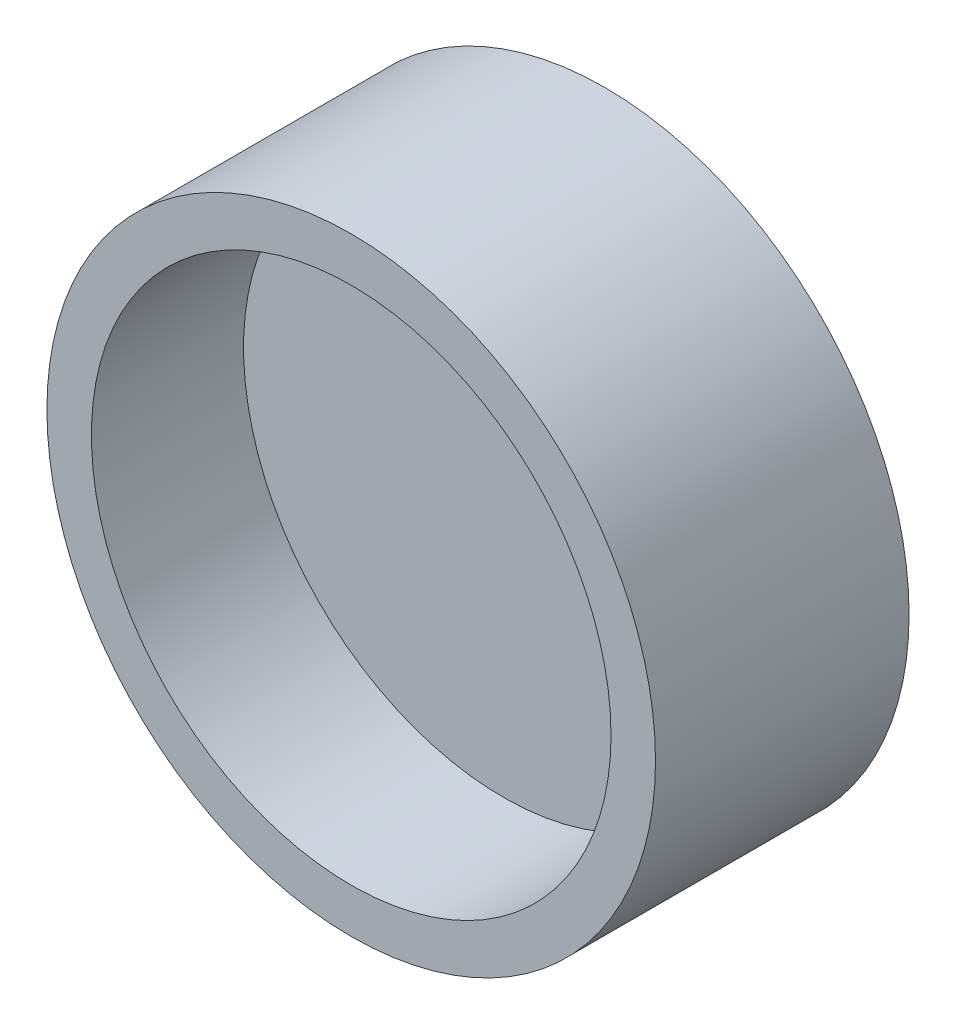
ISO-10303-21;
HEADER;
FILE_DESCRIPTION(('STEP AP214'),'2;1');
FILE_NAME('part.step','',(''),(''),'','','');
FILE_SCHEMA(('AUTOMOTIVE_DESIGN { 1 0 10303 214 1 1 1 1 }'));
ENDSEC;
DATA;
#1=APPLICATION_CONTEXT('core data for automotive mechanical design processes');
#2=APPLICATION_PROTOCOL_DEFINITION('international standard','automotive_design',2000,#1);
#3=PRODUCT_CONTEXT('',#1,'mechanical');
#4=PRODUCT('Part','Part','',(#3));
#5=PRODUCT_RELATED_PRODUCT_CATEGORY('part','',(#4));
#6=PRODUCT_DEFINITION_FORMATION('','',#4);
#7=PRODUCT_DEFINITION_CONTEXT('part definition',#1,'design');
#8=PRODUCT_DEFINITION('design','',#6,#7);
#9=PRODUCT_DEFINITION_SHAPE('','',#8);
#10=(LENGTH_UNIT() NAMED_UNIT(*) SI_UNIT(.MILLI.,.METRE.));
#11=(NAMED_UNIT(*) PLANE_ANGLE_UNIT() SI_UNIT($,.RADIAN.));
#12=(NAMED_UNIT(*) SI_UNIT($,.STERADIAN.) SOLID_ANGLE_UNIT());
#13=UNCERTAINTY_MEASURE_WITH_UNIT(LENGTH_MEASURE(1.E-05),#10,'distance_accuracy_value','');
#14=(GEOMETRIC_REPRESENTATION_CONTEXT(3) GLOBAL_UNCERTAINTY_ASSIGNED_CONTEXT((#13)) GLOBAL_UNIT_ASSIGNED_CONTEXT((#10,
#11,#12)) REPRESENTATION_CONTEXT('',''));
#15=CARTESIAN_POINT('',(0.,0.,0.));
#16=DIRECTION('',(0.,0.,1.));
#17=DIRECTION('',(1.,0.,0.));
#18=AXIS2_PLACEMENT_3D('',#15,#16,#17);
#19=CARTESIAN_POINT('',(0.,0.,10.));
#20=DIRECTION('',(0.,0.,1.));
#21=DIRECTION('',(1.,0.,0.));
#22=AXIS2_PLACEMENT_3D('',#19,#20,#21);
#23=PLANE('',#22);
#24=CARTESIAN_POINT('',(0.,0.,10.));
#25=DIRECTION('',(0.,0.,1.));
#26=DIRECTION('',(1.,0.,0.));
#27=AXIS2_PLACEMENT_3D('',#24,#25,#26);
#28=CIRCLE('',#27,25.6139061614082);
#29=CARTESIAN_POINT('',(25.6139061614082,0.,10.));
#30=VERTEX_POINT('',#29);
#31=EDGE_CURVE('E10',#30,#30,#28,.F.);
#32=ORIENTED_EDGE('',*,*,#31,.F.);
#33=EDGE_LOOP('',(#32));
#34=FACE_BOUND('',#33,.T.);
#35=ADVANCED_FACE('F37',(#34),#23,.T.);
#36=CARTESIAN_POINT('',(0.,0.,25.));
#37=DIRECTION('',(0.,0.,1.));
#38=DIRECTION('',(1.,0.,0.));
#39=AXIS2_PLACEMENT_3D('',#36,#37,#38);
#40=PLANE('',#39);
#41=CARTESIAN_POINT('',(0.,0.,25.));
#42=DIRECTION('',(0.,0.,1.));
#43=DIRECTION('',(1.,0.,0.));
#44=AXIS2_PLACEMENT_3D('',#41,#42,#43);
#45=CIRCLE('',#44,30.);
#46=CARTESIAN_POINT('',(30.,0.,25.));
#47=VERTEX_POINT('',#46);
#48=EDGE_CURVE('E45',#47,#47,#45,.T.);
#49=ORIENTED_EDGE('',*,*,#48,.T.);
#50=EDGE_LOOP('',(#49));
#51=FACE_BOUND('',#50,.T.);
#52=CARTESIAN_POINT('',(0.,0.,25.));
#53=DIRECTION('',(0.,0.,1.));
#54=DIRECTION('',(1.,0.,0.));
#55=AXIS2_PLACEMENT_3D('',#52,#53,#54);
#56=CIRCLE('',#55,25.6139061614082);
#57=CARTESIAN_POINT('',(25.6139061614082,0.,25.));
#58=VERTEX_POINT('',#57);
#59=EDGE_CURVE('E56',#58,#58,#56,.T.);
#60=ORIENTED_EDGE('',*,*,#59,.F.);
#61=EDGE_LOOP('',(#60));
#62=FACE_BOUND('',#61,.T.);
#63=ADVANCED_FACE('F64',(#51,#62),#40,.T.);
#64=CARTESIAN_POINT('',(0.,0.,25.));
#65=DIRECTION('',(0.,0.,-1.));
#66=DIRECTION('',(-1.,0.,0.));
#67=AXIS2_PLACEMENT_3D('',#64,#65,#66);
#68=CYLINDRICAL_SURFACE('',#67,30.);
#69=ORIENTED_EDGE('',*,*,#48,.F.);
#70=EDGE_LOOP('',(#69));
#71=FACE_BOUND('',#70,.T.);
#72=CARTESIAN_POINT('',(0.,0.,0.));
#73=DIRECTION('',(0.,0.,1.));
#74=DIRECTION('',(1.,0.,0.));
#75=AXIS2_PLACEMENT_3D('',#72,#73,#74);
#76=CIRCLE('',#75,30.);
#77=CARTESIAN_POINT('',(30.,0.,0.));
#78=VERTEX_POINT('',#77);
#79=EDGE_CURVE('E50',#78,#78,#76,.T.);
#80=ORIENTED_EDGE('',*,*,#79,.T.);
#81=EDGE_LOOP('',(#80));
#82=FACE_BOUND('',#81,.T.);
#83=ADVANCED_FACE('F66',(#71,#82),#68,.T.);
#84=CARTESIAN_POINT('',(0.,0.,25.));
#85=DIRECTION('',(0.,0.,-1.));
#86=DIRECTION('',(-1.,0.,0.));
#87=AXIS2_PLACEMENT_3D('',#84,#85,#86);
#88=CYLINDRICAL_SURFACE('',#87,25.6139061614082);
#89=ORIENTED_EDGE('',*,*,#31,.T.);
#90=EDGE_LOOP('',(#89));
#91=FACE_BOUND('',#90,.T.);
#92=ORIENTED_EDGE('',*,*,#59,.T.);
#93=EDGE_LOOP('',(#92));
#94=FACE_BOUND('',#93,.T.);
#95=ADVANCED_FACE('F62',(#91,#94),#88,.F.);
#96=CARTESIAN_POINT('',(0.,0.,0.));
#97=DIRECTION('',(0.,0.,1.));
#98=DIRECTION('',(1.,0.,0.));
#99=AXIS2_PLACEMENT_3D('',#96,#97,#98);
#100=PLANE('',#99);
#101=ORIENTED_EDGE('',*,*,#79,.F.);
#102=EDGE_LOOP('',(#101));
#103=FACE_BOUND('',#102,.T.);
#104=ADVANCED_FACE('F39',(#103),#100,.F.);
#105=CLOSED_SHELL('',(#35,#63,#83,#95,#104));
#106=MANIFOLD_SOLID_BREP('B2',#105);
#107=ADVANCED_BREP_SHAPE_REPRESENTATION('',(#18,#106),#14);
#108=SHAPE_DEFINITION_REPRESENTATION(#9,#107);
ENDSEC;
END-ISO-10303-21;
